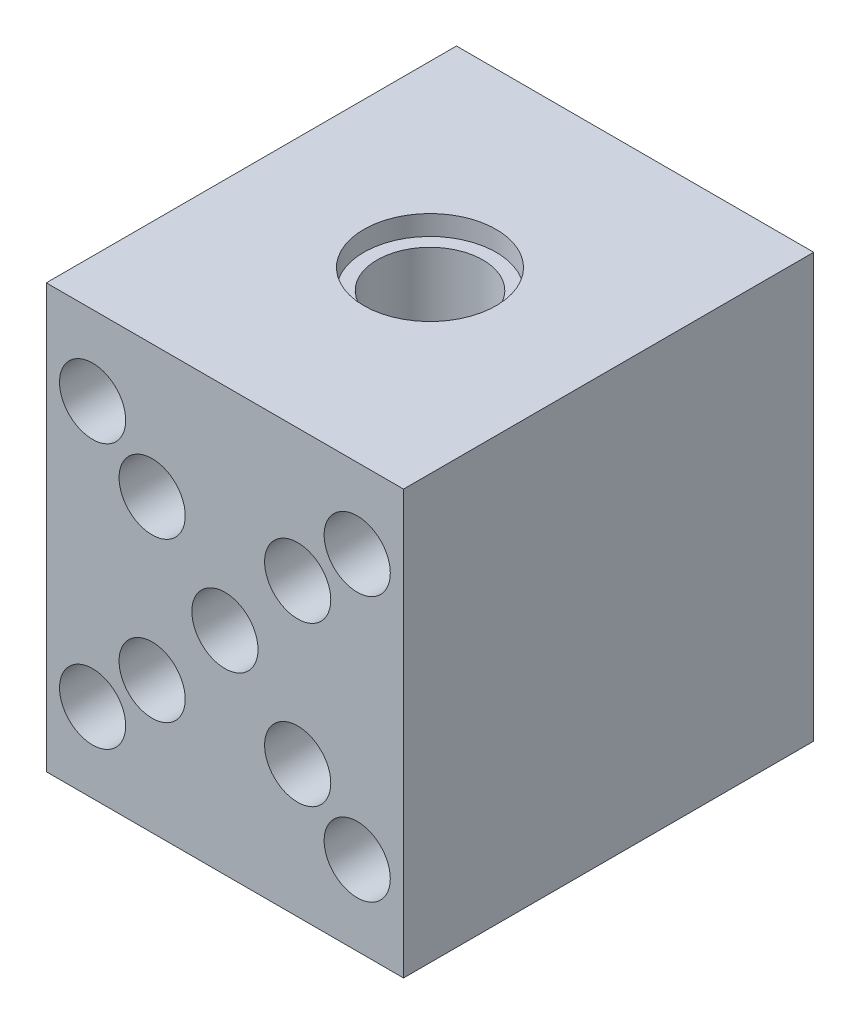
ISO-10303-21;
HEADER;
FILE_DESCRIPTION(('STEP AP214'),'2;1');
FILE_NAME('part.step','',(''),(''),'','','');
FILE_SCHEMA(('AUTOMOTIVE_DESIGN { 1 0 10303 214 1 1 1 1 }'));
ENDSEC;
DATA;
#1=APPLICATION_CONTEXT('core data for automotive mechanical design processes');
#2=APPLICATION_PROTOCOL_DEFINITION('international standard','automotive_design',2000,#1);
#3=PRODUCT_CONTEXT('',#1,'mechanical');
#4=PRODUCT('Part','Part','',(#3));
#5=PRODUCT_RELATED_PRODUCT_CATEGORY('part','',(#4));
#6=PRODUCT_DEFINITION_FORMATION('','',#4);
#7=PRODUCT_DEFINITION_CONTEXT('part definition',#1,'design');
#8=PRODUCT_DEFINITION('design','',#6,#7);
#9=PRODUCT_DEFINITION_SHAPE('','',#8);
#10=(LENGTH_UNIT() NAMED_UNIT(*) SI_UNIT(.MILLI.,.METRE.));
#11=(NAMED_UNIT(*) PLANE_ANGLE_UNIT() SI_UNIT($,.RADIAN.));
#12=(NAMED_UNIT(*) SI_UNIT($,.STERADIAN.) SOLID_ANGLE_UNIT());
#13=UNCERTAINTY_MEASURE_WITH_UNIT(LENGTH_MEASURE(1.E-05),#10,'distance_accuracy_value','');
#14=(GEOMETRIC_REPRESENTATION_CONTEXT(3) GLOBAL_UNCERTAINTY_ASSIGNED_CONTEXT((#13)) GLOBAL_UNIT_ASSIGNED_CONTEXT((#10,
#11,#12)) REPRESENTATION_CONTEXT('',''));
#15=CARTESIAN_POINT('',(0.,0.,0.));
#16=DIRECTION('',(0.,0.,1.));
#17=DIRECTION('',(1.,0.,0.));
#18=AXIS2_PLACEMENT_3D('',#15,#16,#17);
#19=CARTESIAN_POINT('',(10.,10.,31.));
#20=DIRECTION('',(0.,0.,-1.));
#21=DIRECTION('',(-1.,0.,0.));
#22=AXIS2_PLACEMENT_3D('',#19,#20,#21);
#23=CYLINDRICAL_SURFACE('',#22,1.5);
#24=CARTESIAN_POINT('',(10.,10.,0.));
#25=DIRECTION('',(0.,0.,-1.));
#26=DIRECTION('',(-1.,0.,0.));
#27=AXIS2_PLACEMENT_3D('',#24,#25,#26);
#28=CIRCLE('',#27,1.5);
#29=CARTESIAN_POINT('',(8.5,10.,0.));
#30=VERTEX_POINT('',#29);
#31=EDGE_CURVE('E115',#30,#30,#28,.T.);
#32=ORIENTED_EDGE('',*,*,#31,.T.);
#33=EDGE_LOOP('',(#32));
#34=FACE_BOUND('',#33,.T.);
#35=CARTESIAN_POINT('',(10.,10.,16.));
#36=DIRECTION('',(0.,0.,1.));
#37=DIRECTION('',(1.,0.,0.));
#38=AXIS2_PLACEMENT_3D('',#35,#36,#37);
#39=CIRCLE('',#38,1.5);
#40=CARTESIAN_POINT('',(11.5,10.,16.));
#41=VERTEX_POINT('',#40);
#42=EDGE_CURVE('E43',#41,#41,#39,.F.);
#43=ORIENTED_EDGE('',*,*,#42,.F.);
#44=EDGE_LOOP('',(#43));
#45=FACE_BOUND('',#44,.T.);
#46=ADVANCED_FACE('F39',(#34,#45),#23,.F.);
#47=CARTESIAN_POINT('',(-10.,10.,31.));
#48=DIRECTION('',(0.,0.,-1.));
#49=DIRECTION('',(-1.,0.,0.));
#50=AXIS2_PLACEMENT_3D('',#47,#48,#49);
#51=CYLINDRICAL_SURFACE('',#50,1.5);
#52=CARTESIAN_POINT('',(-10.,10.,0.));
#53=DIRECTION('',(0.,0.,-1.));
#54=DIRECTION('',(-1.,0.,0.));
#55=AXIS2_PLACEMENT_3D('',#52,#53,#54);
#56=CIRCLE('',#55,1.5);
#57=CARTESIAN_POINT('',(-11.5,10.,0.));
#58=VERTEX_POINT('',#57);
#59=EDGE_CURVE('E172',#58,#58,#56,.T.);
#60=ORIENTED_EDGE('',*,*,#59,.T.);
#61=EDGE_LOOP('',(#60));
#62=FACE_BOUND('',#61,.T.);
#63=CARTESIAN_POINT('',(-10.,10.,16.));
#64=DIRECTION('',(0.,0.,1.));
#65=DIRECTION('',(1.,0.,0.));
#66=AXIS2_PLACEMENT_3D('',#63,#64,#65);
#67=CIRCLE('',#66,1.5);
#68=CARTESIAN_POINT('',(-8.5,10.,16.));
#69=VERTEX_POINT('',#68);
#70=EDGE_CURVE('E146',#69,#69,#67,.F.);
#71=ORIENTED_EDGE('',*,*,#70,.F.);
#72=EDGE_LOOP('',(#71));
#73=FACE_BOUND('',#72,.T.);
#74=ADVANCED_FACE('F211',(#62,#73),#51,.F.);
#75=CARTESIAN_POINT('',(-10.,-10.,31.));
#76=DIRECTION('',(0.,0.,-1.));
#77=DIRECTION('',(-1.,0.,0.));
#78=AXIS2_PLACEMENT_3D('',#75,#76,#77);
#79=CYLINDRICAL_SURFACE('',#78,1.5);
#80=CARTESIAN_POINT('',(-10.,-10.,0.));
#81=DIRECTION('',(0.,0.,-1.));
#82=DIRECTION('',(-1.,0.,0.));
#83=AXIS2_PLACEMENT_3D('',#80,#81,#82);
#84=CIRCLE('',#83,1.5);
#85=CARTESIAN_POINT('',(-11.5,-10.,0.));
#86=VERTEX_POINT('',#85);
#87=EDGE_CURVE('E176',#86,#86,#84,.T.);
#88=ORIENTED_EDGE('',*,*,#87,.T.);
#89=EDGE_LOOP('',(#88));
#90=FACE_BOUND('',#89,.T.);
#91=CARTESIAN_POINT('',(-10.,-10.,16.));
#92=DIRECTION('',(0.,0.,1.));
#93=DIRECTION('',(1.,0.,0.));
#94=AXIS2_PLACEMENT_3D('',#91,#92,#93);
#95=CIRCLE('',#94,1.5);
#96=CARTESIAN_POINT('',(-8.5,-10.,16.));
#97=VERTEX_POINT('',#96);
#98=EDGE_CURVE('E142',#97,#97,#95,.F.);
#99=ORIENTED_EDGE('',*,*,#98,.F.);
#100=EDGE_LOOP('',(#99));
#101=FACE_BOUND('',#100,.T.);
#102=ADVANCED_FACE('F216',(#90,#101),#79,.F.);
#103=CARTESIAN_POINT('',(10.,-10.,31.));
#104=DIRECTION('',(0.,0.,-1.));
#105=DIRECTION('',(-1.,0.,0.));
#106=AXIS2_PLACEMENT_3D('',#103,#104,#105);
#107=CYLINDRICAL_SURFACE('',#106,1.5);
#108=CARTESIAN_POINT('',(10.,-10.,0.));
#109=DIRECTION('',(0.,0.,-1.));
#110=DIRECTION('',(-1.,0.,0.));
#111=AXIS2_PLACEMENT_3D('',#108,#109,#110);
#112=CIRCLE('',#111,1.5);
#113=CARTESIAN_POINT('',(8.5,-10.,0.));
#114=VERTEX_POINT('',#113);
#115=EDGE_CURVE('E130',#114,#114,#112,.T.);
#116=ORIENTED_EDGE('',*,*,#115,.T.);
#117=EDGE_LOOP('',(#116));
#118=FACE_BOUND('',#117,.T.);
#119=CARTESIAN_POINT('',(10.,-10.,16.));
#120=DIRECTION('',(0.,0.,1.));
#121=DIRECTION('',(1.,0.,0.));
#122=AXIS2_PLACEMENT_3D('',#119,#120,#121);
#123=CIRCLE('',#122,1.5);
#124=CARTESIAN_POINT('',(11.5,-10.,16.));
#125=VERTEX_POINT('',#124);
#126=EDGE_CURVE('E138',#125,#125,#123,.F.);
#127=ORIENTED_EDGE('',*,*,#126,.F.);
#128=EDGE_LOOP('',(#127));
#129=FACE_BOUND('',#128,.T.);
#130=ADVANCED_FACE('F220',(#118,#129),#107,.F.);
#131=CARTESIAN_POINT('',(0.,-16.,15.5));
#132=DIRECTION('',(0.,1.,0.));
#133=DIRECTION('',(0.,0.,1.));
#134=AXIS2_PLACEMENT_3D('',#131,#132,#133);
#135=CYLINDRICAL_SURFACE('',#134,4.);
#136=CARTESIAN_POINT('',(0.,14.5,15.5));
#137=DIRECTION('',(0.,1.,0.));
#138=DIRECTION('',(0.,0.,1.));
#139=AXIS2_PLACEMENT_3D('',#136,#137,#138);
#140=CIRCLE('',#139,4.);
#141=CARTESIAN_POINT('',(0.,14.5,19.5));
#142=VERTEX_POINT('',#141);
#143=EDGE_CURVE('E126',#142,#142,#140,.F.);
#144=ORIENTED_EDGE('',*,*,#143,.F.);
#145=EDGE_LOOP('',(#144));
#146=FACE_BOUND('',#145,.T.);
#147=CARTESIAN_POINT('',(0.,-14.5,15.5));
#148=DIRECTION('',(0.,-1.,0.));
#149=DIRECTION('',(0.,0.,-1.));
#150=AXIS2_PLACEMENT_3D('',#147,#148,#149);
#151=CIRCLE('',#150,4.);
#152=CARTESIAN_POINT('',(0.,-14.5,11.5));
#153=VERTEX_POINT('',#152);
#154=EDGE_CURVE('E132',#153,#153,#151,.F.);
#155=ORIENTED_EDGE('',*,*,#154,.F.);
#156=EDGE_LOOP('',(#155));
#157=FACE_BOUND('',#156,.T.);
#158=ADVANCED_FACE('F223',(#146,#157),#135,.F.);
#159=CARTESIAN_POINT('',(13.5,16.,31.));
#160=DIRECTION('',(-1.,0.,0.));
#161=DIRECTION('',(0.,-1.,0.));
#162=AXIS2_PLACEMENT_3D('',#159,#160,#161);
#163=PLANE('',#162);
#164=DIRECTION('',(0.,1.,0.));
#165=VECTOR('',#164,1.);
#166=CARTESIAN_POINT('',(13.5,16.,0.));
#167=LINE('',#166,#165);
#168=CARTESIAN_POINT('',(13.5,-16.,0.));
#169=VERTEX_POINT('',#168);
#170=CARTESIAN_POINT('',(13.5,16.,0.));
#171=VERTEX_POINT('',#170);
#172=EDGE_CURVE('E111',#169,#171,#167,.T.);
#173=ORIENTED_EDGE('',*,*,#172,.T.);
#174=DIRECTION('',(0.,0.,-1.));
#175=VECTOR('',#174,1.);
#176=CARTESIAN_POINT('',(13.5,16.,31.));
#177=LINE('',#176,#175);
#178=CARTESIAN_POINT('',(13.5,16.,31.));
#179=VERTEX_POINT('',#178);
#180=EDGE_CURVE('E11',#179,#171,#177,.T.);
#181=ORIENTED_EDGE('',*,*,#180,.F.);
#182=DIRECTION('',(0.,1.,0.));
#183=VECTOR('',#182,1.);
#184=CARTESIAN_POINT('',(13.5,16.,31.));
#185=LINE('',#184,#183);
#186=CARTESIAN_POINT('',(13.5,-16.,31.));
#187=VERTEX_POINT('',#186);
#188=EDGE_CURVE('E94',#187,#179,#185,.T.);
#189=ORIENTED_EDGE('',*,*,#188,.F.);
#190=DIRECTION('',(0.,0.,-1.));
#191=VECTOR('',#190,1.);
#192=CARTESIAN_POINT('',(13.5,-16.,31.));
#193=LINE('',#192,#191);
#194=EDGE_CURVE('E107',#187,#169,#193,.T.);
#195=ORIENTED_EDGE('',*,*,#194,.T.);
#196=EDGE_LOOP('',(#173,#181,#189,#195));
#197=FACE_BOUND('',#196,.T.);
#198=ADVANCED_FACE('F41',(#197),#163,.F.);
#199=CARTESIAN_POINT('',(-13.5,16.,31.));
#200=DIRECTION('',(0.,-1.,0.));
#201=DIRECTION('',(0.,0.,-1.));
#202=AXIS2_PLACEMENT_3D('',#199,#200,#201);
#203=PLANE('',#202);
#204=CARTESIAN_POINT('',(0.,16.,15.5));
#205=DIRECTION('',(0.,1.,0.));
#206=DIRECTION('',(0.,0.,1.));
#207=AXIS2_PLACEMENT_3D('',#204,#205,#206);
#208=CIRCLE('',#207,5.);
#209=CARTESIAN_POINT('',(0.,16.,20.5));
#210=VERTEX_POINT('',#209);
#211=EDGE_CURVE('E136',#210,#210,#208,.T.);
#212=ORIENTED_EDGE('',*,*,#211,.F.);
#213=EDGE_LOOP('',(#212));
#214=FACE_BOUND('',#213,.T.);
#215=DIRECTION('',(-1.,0.,0.));
#216=VECTOR('',#215,1.);
#217=CARTESIAN_POINT('',(-13.5,16.,0.));
#218=LINE('',#217,#216);
#219=CARTESIAN_POINT('',(-13.5,16.,0.));
#220=VERTEX_POINT('',#219);
#221=EDGE_CURVE('E99',#171,#220,#218,.T.);
#222=ORIENTED_EDGE('',*,*,#221,.T.);
#223=DIRECTION('',(0.,0.,-1.));
#224=VECTOR('',#223,1.);
#225=CARTESIAN_POINT('',(-13.5,16.,31.));
#226=LINE('',#225,#224);
#227=CARTESIAN_POINT('',(-13.5,16.,31.));
#228=VERTEX_POINT('',#227);
#229=EDGE_CURVE('E50',#228,#220,#226,.T.);
#230=ORIENTED_EDGE('',*,*,#229,.F.);
#231=DIRECTION('',(-1.,0.,0.));
#232=VECTOR('',#231,1.);
#233=CARTESIAN_POINT('',(-13.5,16.,31.));
#234=LINE('',#233,#232);
#235=EDGE_CURVE('E89',#179,#228,#234,.T.);
#236=ORIENTED_EDGE('',*,*,#235,.F.);
#237=ORIENTED_EDGE('',*,*,#180,.T.);
#238=EDGE_LOOP('',(#222,#230,#236,#237));
#239=FACE_BOUND('',#238,.T.);
#240=ADVANCED_FACE('F98',(#214,#239),#203,.F.);
#241=CARTESIAN_POINT('',(-13.5,16.,31.));
#242=DIRECTION('',(1.,0.,0.));
#243=DIRECTION('',(0.,1.,0.));
#244=AXIS2_PLACEMENT_3D('',#241,#242,#243);
#245=PLANE('',#244);
#246=DIRECTION('',(0.,-1.,0.));
#247=VECTOR('',#246,1.);
#248=CARTESIAN_POINT('',(-13.5,16.,0.));
#249=LINE('',#248,#247);
#250=CARTESIAN_POINT('',(-13.5,-16.,0.));
#251=VERTEX_POINT('',#250);
#252=EDGE_CURVE('E76',#220,#251,#249,.T.);
#253=ORIENTED_EDGE('',*,*,#252,.T.);
#254=DIRECTION('',(0.,0.,-1.));
#255=VECTOR('',#254,1.);
#256=CARTESIAN_POINT('',(-13.5,-16.,31.));
#257=LINE('',#256,#255);
#258=CARTESIAN_POINT('',(-13.5,-16.,31.));
#259=VERTEX_POINT('',#258);
#260=EDGE_CURVE('E101',#259,#251,#257,.T.);
#261=ORIENTED_EDGE('',*,*,#260,.F.);
#262=DIRECTION('',(0.,-1.,0.));
#263=VECTOR('',#262,1.);
#264=CARTESIAN_POINT('',(-13.5,16.,31.));
#265=LINE('',#264,#263);
#266=EDGE_CURVE('E92',#228,#259,#265,.T.);
#267=ORIENTED_EDGE('',*,*,#266,.F.);
#268=ORIENTED_EDGE('',*,*,#229,.T.);
#269=EDGE_LOOP('',(#253,#261,#267,#268));
#270=FACE_BOUND('',#269,.T.);
#271=ADVANCED_FACE('F103',(#270),#245,.F.);
#272=CARTESIAN_POINT('',(-13.5,-16.,31.));
#273=DIRECTION('',(0.,1.,0.));
#274=DIRECTION('',(0.,0.,1.));
#275=AXIS2_PLACEMENT_3D('',#272,#273,#274);
#276=PLANE('',#275);
#277=CARTESIAN_POINT('',(0.,-16.,15.5));
#278=DIRECTION('',(0.,-1.,0.));
#279=DIRECTION('',(0.,0.,-1.));
#280=AXIS2_PLACEMENT_3D('',#277,#278,#279);
#281=CIRCLE('',#280,5.);
#282=CARTESIAN_POINT('',(0.,-16.,10.5));
#283=VERTEX_POINT('',#282);
#284=EDGE_CURVE('E153',#283,#283,#281,.T.);
#285=ORIENTED_EDGE('',*,*,#284,.F.);
#286=EDGE_LOOP('',(#285));
#287=FACE_BOUND('',#286,.T.);
#288=DIRECTION('',(1.,0.,0.));
#289=VECTOR('',#288,1.);
#290=CARTESIAN_POINT('',(-13.5,-16.,0.));
#291=LINE('',#290,#289);
#292=EDGE_CURVE('E82',#251,#169,#291,.T.);
#293=ORIENTED_EDGE('',*,*,#292,.T.);
#294=ORIENTED_EDGE('',*,*,#194,.F.);
#295=DIRECTION('',(1.,0.,0.));
#296=VECTOR('',#295,1.);
#297=CARTESIAN_POINT('',(-13.5,-16.,31.));
#298=LINE('',#297,#296);
#299=EDGE_CURVE('E59',#259,#187,#298,.T.);
#300=ORIENTED_EDGE('',*,*,#299,.F.);
#301=ORIENTED_EDGE('',*,*,#260,.T.);
#302=EDGE_LOOP('',(#293,#294,#300,#301));
#303=FACE_BOUND('',#302,.T.);
#304=ADVANCED_FACE('F198',(#287,#303),#276,.F.);
#305=CARTESIAN_POINT('',(0.,0.,31.));
#306=DIRECTION('',(0.,0.,1.));
#307=DIRECTION('',(1.,0.,0.));
#308=AXIS2_PLACEMENT_3D('',#305,#306,#307);
#309=PLANE('',#308);
#310=CARTESIAN_POINT('',(-5.5,-6.,31.));
#311=DIRECTION('',(0.,0.,1.));
#312=DIRECTION('',(1.,0.,0.));
#313=AXIS2_PLACEMENT_3D('',#310,#311,#312);
#314=CIRCLE('',#313,2.5);
#315=CARTESIAN_POINT('',(-3.,-6.,31.));
#316=VERTEX_POINT('',#315);
#317=EDGE_CURVE('E354',#316,#316,#314,.T.);
#318=ORIENTED_EDGE('',*,*,#317,.F.);
#319=EDGE_LOOP('',(#318));
#320=FACE_BOUND('',#319,.T.);
#321=CARTESIAN_POINT('',(5.5,-6.,31.));
#322=DIRECTION('',(0.,0.,1.));
#323=DIRECTION('',(1.,0.,0.));
#324=AXIS2_PLACEMENT_3D('',#321,#322,#323);
#325=CIRCLE('',#324,2.5);
#326=CARTESIAN_POINT('',(8.,-6.,31.));
#327=VERTEX_POINT('',#326);
#328=EDGE_CURVE('E346',#327,#327,#325,.T.);
#329=ORIENTED_EDGE('',*,*,#328,.F.);
#330=EDGE_LOOP('',(#329));
#331=FACE_BOUND('',#330,.T.);
#332=CARTESIAN_POINT('',(0.,0.,31.));
#333=DIRECTION('',(0.,0.,1.));
#334=DIRECTION('',(1.,0.,0.));
#335=AXIS2_PLACEMENT_3D('',#332,#333,#334);
#336=CIRCLE('',#335,2.5);
#337=CARTESIAN_POINT('',(2.5,0.,31.));
#338=VERTEX_POINT('',#337);
#339=EDGE_CURVE('E338',#338,#338,#336,.T.);
#340=ORIENTED_EDGE('',*,*,#339,.F.);
#341=EDGE_LOOP('',(#340));
#342=FACE_BOUND('',#341,.T.);
#343=CARTESIAN_POINT('',(5.5,6.,31.));
#344=DIRECTION('',(0.,0.,1.));
#345=DIRECTION('',(1.,0.,0.));
#346=AXIS2_PLACEMENT_3D('',#343,#344,#345);
#347=CIRCLE('',#346,2.5);
#348=CARTESIAN_POINT('',(8.,6.,31.));
#349=VERTEX_POINT('',#348);
#350=EDGE_CURVE('E324',#349,#349,#347,.T.);
#351=ORIENTED_EDGE('',*,*,#350,.F.);
#352=EDGE_LOOP('',(#351));
#353=FACE_BOUND('',#352,.T.);
#354=CARTESIAN_POINT('',(-5.5,6.,31.));
#355=DIRECTION('',(0.,0.,1.));
#356=DIRECTION('',(1.,0.,0.));
#357=AXIS2_PLACEMENT_3D('',#354,#355,#356);
#358=CIRCLE('',#357,2.5);
#359=CARTESIAN_POINT('',(-3.,6.,31.));
#360=VERTEX_POINT('',#359);
#361=EDGE_CURVE('E323',#360,#360,#358,.T.);
#362=ORIENTED_EDGE('',*,*,#361,.F.);
#363=EDGE_LOOP('',(#362));
#364=FACE_BOUND('',#363,.T.);
#365=CARTESIAN_POINT('',(-10.,-10.,31.));
#366=DIRECTION('',(0.,0.,1.));
#367=DIRECTION('',(1.,0.,0.));
#368=AXIS2_PLACEMENT_3D('',#365,#366,#367);
#369=CIRCLE('',#368,2.5);
#370=CARTESIAN_POINT('',(-7.5,-10.,31.));
#371=VERTEX_POINT('',#370);
#372=EDGE_CURVE('E360',#371,#371,#369,.T.);
#373=ORIENTED_EDGE('',*,*,#372,.F.);
#374=EDGE_LOOP('',(#373));
#375=FACE_BOUND('',#374,.T.);
#376=CARTESIAN_POINT('',(10.,-10.,31.));
#377=DIRECTION('',(0.,0.,1.));
#378=DIRECTION('',(1.,0.,0.));
#379=AXIS2_PLACEMENT_3D('',#376,#377,#378);
#380=CIRCLE('',#379,2.5);
#381=CARTESIAN_POINT('',(12.5,-10.,31.));
#382=VERTEX_POINT('',#381);
#383=EDGE_CURVE('E375',#382,#382,#380,.T.);
#384=ORIENTED_EDGE('',*,*,#383,.F.);
#385=EDGE_LOOP('',(#384));
#386=FACE_BOUND('',#385,.T.);
#387=CARTESIAN_POINT('',(10.,10.,31.));
#388=DIRECTION('',(0.,0.,1.));
#389=DIRECTION('',(1.,0.,0.));
#390=AXIS2_PLACEMENT_3D('',#387,#388,#389);
#391=CIRCLE('',#390,2.5);
#392=CARTESIAN_POINT('',(12.5,10.,31.));
#393=VERTEX_POINT('',#392);
#394=EDGE_CURVE('E367',#393,#393,#391,.T.);
#395=ORIENTED_EDGE('',*,*,#394,.F.);
#396=EDGE_LOOP('',(#395));
#397=FACE_BOUND('',#396,.T.);
#398=CARTESIAN_POINT('',(-10.,10.,31.));
#399=DIRECTION('',(0.,0.,1.));
#400=DIRECTION('',(1.,0.,0.));
#401=AXIS2_PLACEMENT_3D('',#398,#399,#400);
#402=CIRCLE('',#401,2.5);
#403=CARTESIAN_POINT('',(-7.5,10.,31.));
#404=VERTEX_POINT('',#403);
#405=EDGE_CURVE('E366',#404,#404,#402,.T.);
#406=ORIENTED_EDGE('',*,*,#405,.F.);
#407=EDGE_LOOP('',(#406));
#408=FACE_BOUND('',#407,.T.);
#409=ORIENTED_EDGE('',*,*,#188,.T.);
#410=ORIENTED_EDGE('',*,*,#235,.T.);
#411=ORIENTED_EDGE('',*,*,#266,.T.);
#412=ORIENTED_EDGE('',*,*,#299,.T.);
#413=EDGE_LOOP('',(#409,#410,#411,#412));
#414=FACE_BOUND('',#413,.T.);
#415=ADVANCED_FACE('F90',(#320,#331,#342,#353,#364,#375,#386,#397,#408,#414),#309,.T.);
#416=CARTESIAN_POINT('',(0.,0.,0.));
#417=DIRECTION('',(0.,0.,1.));
#418=DIRECTION('',(1.,0.,0.));
#419=AXIS2_PLACEMENT_3D('',#416,#417,#418);
#420=PLANE('',#419);
#421=ORIENTED_EDGE('',*,*,#115,.F.);
#422=EDGE_LOOP('',(#421));
#423=FACE_BOUND('',#422,.T.);
#424=ORIENTED_EDGE('',*,*,#87,.F.);
#425=EDGE_LOOP('',(#424));
#426=FACE_BOUND('',#425,.T.);
#427=ORIENTED_EDGE('',*,*,#59,.F.);
#428=EDGE_LOOP('',(#427));
#429=FACE_BOUND('',#428,.T.);
#430=ORIENTED_EDGE('',*,*,#31,.F.);
#431=EDGE_LOOP('',(#430));
#432=FACE_BOUND('',#431,.T.);
#433=ORIENTED_EDGE('',*,*,#172,.F.);
#434=ORIENTED_EDGE('',*,*,#292,.F.);
#435=ORIENTED_EDGE('',*,*,#252,.F.);
#436=ORIENTED_EDGE('',*,*,#221,.F.);
#437=EDGE_LOOP('',(#433,#434,#435,#436));
#438=FACE_BOUND('',#437,.T.);
#439=ADVANCED_FACE('F190',(#423,#426,#429,#432,#438),#420,.F.);
#440=CARTESIAN_POINT('',(0.,14.5,15.5));
#441=DIRECTION('',(0.,1.,0.));
#442=DIRECTION('',(0.,0.,1.));
#443=AXIS2_PLACEMENT_3D('',#440,#441,#442);
#444=PLANE('',#443);
#445=CARTESIAN_POINT('',(0.,14.5,15.5));
#446=DIRECTION('',(0.,1.,0.));
#447=DIRECTION('',(0.,0.,1.));
#448=AXIS2_PLACEMENT_3D('',#445,#446,#447);
#449=CIRCLE('',#448,5.);
#450=CARTESIAN_POINT('',(0.,14.5,20.5));
#451=VERTEX_POINT('',#450);
#452=EDGE_CURVE('E131',#451,#451,#449,.T.);
#453=ORIENTED_EDGE('',*,*,#452,.T.);
#454=EDGE_LOOP('',(#453));
#455=FACE_BOUND('',#454,.T.);
#456=ORIENTED_EDGE('',*,*,#143,.T.);
#457=EDGE_LOOP('',(#456));
#458=FACE_BOUND('',#457,.T.);
#459=ADVANCED_FACE('F193',(#455,#458),#444,.T.);
#460=CARTESIAN_POINT('',(0.,14.5,15.5));
#461=DIRECTION('',(0.,1.,0.));
#462=DIRECTION('',(0.,0.,1.));
#463=AXIS2_PLACEMENT_3D('',#460,#461,#462);
#464=CYLINDRICAL_SURFACE('',#463,5.);
#465=ORIENTED_EDGE('',*,*,#452,.F.);
#466=EDGE_LOOP('',(#465));
#467=FACE_BOUND('',#466,.T.);
#468=ORIENTED_EDGE('',*,*,#211,.T.);
#469=EDGE_LOOP('',(#468));
#470=FACE_BOUND('',#469,.T.);
#471=ADVANCED_FACE('F231',(#467,#470),#464,.F.);
#472=CARTESIAN_POINT('',(0.,-14.5,15.5));
#473=DIRECTION('',(0.,-1.,0.));
#474=DIRECTION('',(0.,0.,-1.));
#475=AXIS2_PLACEMENT_3D('',#472,#473,#474);
#476=PLANE('',#475);
#477=CARTESIAN_POINT('',(0.,-14.5,15.5));
#478=DIRECTION('',(0.,-1.,0.));
#479=DIRECTION('',(0.,0.,-1.));
#480=AXIS2_PLACEMENT_3D('',#477,#478,#479);
#481=CIRCLE('',#480,5.);
#482=CARTESIAN_POINT('',(0.,-14.5,10.5));
#483=VERTEX_POINT('',#482);
#484=EDGE_CURVE('E137',#483,#483,#481,.T.);
#485=ORIENTED_EDGE('',*,*,#484,.T.);
#486=EDGE_LOOP('',(#485));
#487=FACE_BOUND('',#486,.T.);
#488=ORIENTED_EDGE('',*,*,#154,.T.);
#489=EDGE_LOOP('',(#488));
#490=FACE_BOUND('',#489,.T.);
#491=ADVANCED_FACE('F234',(#487,#490),#476,.T.);
#492=CARTESIAN_POINT('',(0.,-14.5,15.5));
#493=DIRECTION('',(0.,-1.,0.));
#494=DIRECTION('',(0.,0.,-1.));
#495=AXIS2_PLACEMENT_3D('',#492,#493,#494);
#496=CYLINDRICAL_SURFACE('',#495,5.);
#497=ORIENTED_EDGE('',*,*,#484,.F.);
#498=EDGE_LOOP('',(#497));
#499=FACE_BOUND('',#498,.T.);
#500=ORIENTED_EDGE('',*,*,#284,.T.);
#501=EDGE_LOOP('',(#500));
#502=FACE_BOUND('',#501,.T.);
#503=ADVANCED_FACE('F239',(#499,#502),#496,.F.);
#504=CARTESIAN_POINT('',(10.,-10.,16.));
#505=DIRECTION('',(0.,0.,1.));
#506=DIRECTION('',(1.,0.,0.));
#507=AXIS2_PLACEMENT_3D('',#504,#505,#506);
#508=PLANE('',#507);
#509=CARTESIAN_POINT('',(10.,-10.,16.));
#510=DIRECTION('',(0.,0.,1.));
#511=DIRECTION('',(1.,0.,0.));
#512=AXIS2_PLACEMENT_3D('',#509,#510,#511);
#513=CIRCLE('',#512,2.5);
#514=CARTESIAN_POINT('',(12.5,-10.,16.));
#515=VERTEX_POINT('',#514);
#516=EDGE_CURVE('E371',#515,#515,#513,.T.);
#517=ORIENTED_EDGE('',*,*,#516,.T.);
#518=EDGE_LOOP('',(#517));
#519=FACE_BOUND('',#518,.T.);
#520=ORIENTED_EDGE('',*,*,#126,.T.);
#521=EDGE_LOOP('',(#520));
#522=FACE_BOUND('',#521,.T.);
#523=ADVANCED_FACE('F242',(#519,#522),#508,.T.);
#524=CARTESIAN_POINT('',(10.,-10.,16.));
#525=DIRECTION('',(0.,0.,1.));
#526=DIRECTION('',(1.,0.,0.));
#527=AXIS2_PLACEMENT_3D('',#524,#525,#526);
#528=CYLINDRICAL_SURFACE('',#527,2.5);
#529=ORIENTED_EDGE('',*,*,#516,.F.);
#530=EDGE_LOOP('',(#529));
#531=FACE_BOUND('',#530,.T.);
#532=ORIENTED_EDGE('',*,*,#383,.T.);
#533=EDGE_LOOP('',(#532));
#534=FACE_BOUND('',#533,.T.);
#535=ADVANCED_FACE('F263',(#531,#534),#528,.F.);
#536=CARTESIAN_POINT('',(-10.,-10.,16.));
#537=DIRECTION('',(0.,0.,1.));
#538=DIRECTION('',(1.,0.,0.));
#539=AXIS2_PLACEMENT_3D('',#536,#537,#538);
#540=PLANE('',#539);
#541=CARTESIAN_POINT('',(-10.,-10.,16.));
#542=DIRECTION('',(0.,0.,1.));
#543=DIRECTION('',(1.,0.,0.));
#544=AXIS2_PLACEMENT_3D('',#541,#542,#543);
#545=CIRCLE('',#544,2.5);
#546=CARTESIAN_POINT('',(-7.5,-10.,16.));
#547=VERTEX_POINT('',#546);
#548=EDGE_CURVE('E379',#547,#547,#545,.T.);
#549=ORIENTED_EDGE('',*,*,#548,.T.);
#550=EDGE_LOOP('',(#549));
#551=FACE_BOUND('',#550,.T.);
#552=ORIENTED_EDGE('',*,*,#98,.T.);
#553=EDGE_LOOP('',(#552));
#554=FACE_BOUND('',#553,.T.);
#555=ADVANCED_FACE('F259',(#551,#554),#540,.T.);
#556=CARTESIAN_POINT('',(-10.,-10.,16.));
#557=DIRECTION('',(0.,0.,1.));
#558=DIRECTION('',(1.,0.,0.));
#559=AXIS2_PLACEMENT_3D('',#556,#557,#558);
#560=CYLINDRICAL_SURFACE('',#559,2.5);
#561=ORIENTED_EDGE('',*,*,#548,.F.);
#562=EDGE_LOOP('',(#561));
#563=FACE_BOUND('',#562,.T.);
#564=ORIENTED_EDGE('',*,*,#372,.T.);
#565=EDGE_LOOP('',(#564));
#566=FACE_BOUND('',#565,.T.);
#567=ADVANCED_FACE('F255',(#563,#566),#560,.F.);
#568=CARTESIAN_POINT('',(-10.,10.,16.));
#569=DIRECTION('',(0.,0.,1.));
#570=DIRECTION('',(1.,0.,0.));
#571=AXIS2_PLACEMENT_3D('',#568,#569,#570);
#572=PLANE('',#571);
#573=CARTESIAN_POINT('',(-10.,10.,16.));
#574=DIRECTION('',(0.,0.,1.));
#575=DIRECTION('',(1.,0.,0.));
#576=AXIS2_PLACEMENT_3D('',#573,#574,#575);
#577=CIRCLE('',#576,2.5);
#578=CARTESIAN_POINT('',(-7.5,10.,16.));
#579=VERTEX_POINT('',#578);
#580=EDGE_CURVE('E143',#579,#579,#577,.T.);
#581=ORIENTED_EDGE('',*,*,#580,.T.);
#582=EDGE_LOOP('',(#581));
#583=FACE_BOUND('',#582,.T.);
#584=ORIENTED_EDGE('',*,*,#70,.T.);
#585=EDGE_LOOP('',(#584));
#586=FACE_BOUND('',#585,.T.);
#587=ADVANCED_FACE('F251',(#583,#586),#572,.T.);
#588=CARTESIAN_POINT('',(-10.,10.,16.));
#589=DIRECTION('',(0.,0.,1.));
#590=DIRECTION('',(1.,0.,0.));
#591=AXIS2_PLACEMENT_3D('',#588,#589,#590);
#592=CYLINDRICAL_SURFACE('',#591,2.5);
#593=ORIENTED_EDGE('',*,*,#580,.F.);
#594=EDGE_LOOP('',(#593));
#595=FACE_BOUND('',#594,.T.);
#596=ORIENTED_EDGE('',*,*,#405,.T.);
#597=EDGE_LOOP('',(#596));
#598=FACE_BOUND('',#597,.T.);
#599=ADVANCED_FACE('F247',(#595,#598),#592,.F.);
#600=CARTESIAN_POINT('',(10.,10.,16.));
#601=DIRECTION('',(0.,0.,1.));
#602=DIRECTION('',(1.,0.,0.));
#603=AXIS2_PLACEMENT_3D('',#600,#601,#602);
#604=PLANE('',#603);
#605=CARTESIAN_POINT('',(10.,10.,16.));
#606=DIRECTION('',(0.,0.,1.));
#607=DIRECTION('',(1.,0.,0.));
#608=AXIS2_PLACEMENT_3D('',#605,#606,#607);
#609=CIRCLE('',#608,2.5);
#610=CARTESIAN_POINT('',(12.5,10.,16.));
#611=VERTEX_POINT('',#610);
#612=EDGE_CURVE('E362',#611,#611,#609,.T.);
#613=ORIENTED_EDGE('',*,*,#612,.T.);
#614=EDGE_LOOP('',(#613));
#615=FACE_BOUND('',#614,.T.);
#616=ORIENTED_EDGE('',*,*,#42,.T.);
#617=EDGE_LOOP('',(#616));
#618=FACE_BOUND('',#617,.T.);
#619=ADVANCED_FACE('F250',(#615,#618),#604,.T.);
#620=CARTESIAN_POINT('',(10.,10.,16.));
#621=DIRECTION('',(0.,0.,1.));
#622=DIRECTION('',(1.,0.,0.));
#623=AXIS2_PLACEMENT_3D('',#620,#621,#622);
#624=CYLINDRICAL_SURFACE('',#623,2.5);
#625=ORIENTED_EDGE('',*,*,#612,.F.);
#626=EDGE_LOOP('',(#625));
#627=FACE_BOUND('',#626,.T.);
#628=ORIENTED_EDGE('',*,*,#394,.T.);
#629=EDGE_LOOP('',(#628));
#630=FACE_BOUND('',#629,.T.);
#631=ADVANCED_FACE('F271',(#627,#630),#624,.F.);
#632=CARTESIAN_POINT('',(-5.5,6.,21.));
#633=DIRECTION('',(0.,0.,1.));
#634=DIRECTION('',(1.,0.,0.));
#635=AXIS2_PLACEMENT_3D('',#632,#633,#634);
#636=CYLINDRICAL_SURFACE('',#635,2.5);
#637=CARTESIAN_POINT('',(-5.5,6.,21.));
#638=DIRECTION('',(0.,0.,1.));
#639=DIRECTION('',(1.,0.,0.));
#640=AXIS2_PLACEMENT_3D('',#637,#638,#639);
#641=CIRCLE('',#640,2.5);
#642=CARTESIAN_POINT('',(-3.,6.,21.));
#643=VERTEX_POINT('',#642);
#644=EDGE_CURVE('E329',#643,#643,#641,.T.);
#645=ORIENTED_EDGE('',*,*,#644,.F.);
#646=EDGE_LOOP('',(#645));
#647=FACE_BOUND('',#646,.T.);
#648=ORIENTED_EDGE('',*,*,#361,.T.);
#649=EDGE_LOOP('',(#648));
#650=FACE_BOUND('',#649,.T.);
#651=ADVANCED_FACE('F274',(#647,#650),#636,.F.);
#652=CARTESIAN_POINT('',(-5.5,6.,21.));
#653=DIRECTION('',(0.,0.,1.));
#654=DIRECTION('',(1.,0.,0.));
#655=AXIS2_PLACEMENT_3D('',#652,#653,#654);
#656=PLANE('',#655);
#657=ORIENTED_EDGE('',*,*,#644,.T.);
#658=EDGE_LOOP('',(#657));
#659=FACE_BOUND('',#658,.T.);
#660=ADVANCED_FACE('F281',(#659),#656,.T.);
#661=CARTESIAN_POINT('',(5.5,6.,21.));
#662=DIRECTION('',(0.,0.,1.));
#663=DIRECTION('',(1.,0.,0.));
#664=AXIS2_PLACEMENT_3D('',#661,#662,#663);
#665=CYLINDRICAL_SURFACE('',#664,2.5);
#666=CARTESIAN_POINT('',(5.5,6.,21.));
#667=DIRECTION('',(0.,0.,1.));
#668=DIRECTION('',(1.,0.,0.));
#669=AXIS2_PLACEMENT_3D('',#666,#667,#668);
#670=CIRCLE('',#669,2.5);
#671=CARTESIAN_POINT('',(8.,6.,21.));
#672=VERTEX_POINT('',#671);
#673=EDGE_CURVE('E321',#672,#672,#670,.T.);
#674=ORIENTED_EDGE('',*,*,#673,.F.);
#675=EDGE_LOOP('',(#674));
#676=FACE_BOUND('',#675,.T.);
#677=ORIENTED_EDGE('',*,*,#350,.T.);
#678=EDGE_LOOP('',(#677));
#679=FACE_BOUND('',#678,.T.);
#680=ADVANCED_FACE('F285',(#676,#679),#665,.F.);
#681=CARTESIAN_POINT('',(5.5,6.,21.));
#682=DIRECTION('',(0.,0.,1.));
#683=DIRECTION('',(1.,0.,0.));
#684=AXIS2_PLACEMENT_3D('',#681,#682,#683);
#685=PLANE('',#684);
#686=ORIENTED_EDGE('',*,*,#673,.T.);
#687=EDGE_LOOP('',(#686));
#688=FACE_BOUND('',#687,.T.);
#689=ADVANCED_FACE('F307',(#688),#685,.T.);
#690=CARTESIAN_POINT('',(0.,0.,21.));
#691=DIRECTION('',(0.,0.,1.));
#692=DIRECTION('',(1.,0.,0.));
#693=AXIS2_PLACEMENT_3D('',#690,#691,#692);
#694=CYLINDRICAL_SURFACE('',#693,2.5);
#695=CARTESIAN_POINT('',(0.,0.,21.));
#696=DIRECTION('',(0.,0.,1.));
#697=DIRECTION('',(1.,0.,0.));
#698=AXIS2_PLACEMENT_3D('',#695,#696,#697);
#699=CIRCLE('',#698,2.5);
#700=CARTESIAN_POINT('',(2.5,0.,21.));
#701=VERTEX_POINT('',#700);
#702=EDGE_CURVE('E332',#701,#701,#699,.T.);
#703=ORIENTED_EDGE('',*,*,#702,.F.);
#704=EDGE_LOOP('',(#703));
#705=FACE_BOUND('',#704,.T.);
#706=ORIENTED_EDGE('',*,*,#339,.T.);
#707=EDGE_LOOP('',(#706));
#708=FACE_BOUND('',#707,.T.);
#709=ADVANCED_FACE('F304',(#705,#708),#694,.F.);
#710=CARTESIAN_POINT('',(0.,0.,21.));
#711=DIRECTION('',(0.,0.,1.));
#712=DIRECTION('',(1.,0.,0.));
#713=AXIS2_PLACEMENT_3D('',#710,#711,#712);
#714=PLANE('',#713);
#715=ORIENTED_EDGE('',*,*,#702,.T.);
#716=EDGE_LOOP('',(#715));
#717=FACE_BOUND('',#716,.T.);
#718=ADVANCED_FACE('F299',(#717),#714,.T.);
#719=CARTESIAN_POINT('',(5.5,-6.,21.));
#720=DIRECTION('',(0.,0.,1.));
#721=DIRECTION('',(1.,0.,0.));
#722=AXIS2_PLACEMENT_3D('',#719,#720,#721);
#723=CYLINDRICAL_SURFACE('',#722,2.5);
#724=CARTESIAN_POINT('',(5.5,-6.,21.));
#725=DIRECTION('',(0.,0.,1.));
#726=DIRECTION('',(1.,0.,0.));
#727=AXIS2_PLACEMENT_3D('',#724,#725,#726);
#728=CIRCLE('',#727,2.5);
#729=CARTESIAN_POINT('',(8.,-6.,21.));
#730=VERTEX_POINT('',#729);
#731=EDGE_CURVE('E342',#730,#730,#728,.T.);
#732=ORIENTED_EDGE('',*,*,#731,.F.);
#733=EDGE_LOOP('',(#732));
#734=FACE_BOUND('',#733,.T.);
#735=ORIENTED_EDGE('',*,*,#328,.T.);
#736=EDGE_LOOP('',(#735));
#737=FACE_BOUND('',#736,.T.);
#738=ADVANCED_FACE('F296',(#734,#737),#723,.F.);
#739=CARTESIAN_POINT('',(5.5,-6.,21.));
#740=DIRECTION('',(0.,0.,1.));
#741=DIRECTION('',(1.,0.,0.));
#742=AXIS2_PLACEMENT_3D('',#739,#740,#741);
#743=PLANE('',#742);
#744=ORIENTED_EDGE('',*,*,#731,.T.);
#745=EDGE_LOOP('',(#744));
#746=FACE_BOUND('',#745,.T.);
#747=ADVANCED_FACE('F291',(#746),#743,.T.);
#748=CARTESIAN_POINT('',(-5.5,-6.,21.));
#749=DIRECTION('',(0.,0.,1.));
#750=DIRECTION('',(1.,0.,0.));
#751=AXIS2_PLACEMENT_3D('',#748,#749,#750);
#752=CYLINDRICAL_SURFACE('',#751,2.5);
#753=CARTESIAN_POINT('',(-5.5,-6.,21.));
#754=DIRECTION('',(0.,0.,1.));
#755=DIRECTION('',(1.,0.,0.));
#756=AXIS2_PLACEMENT_3D('',#753,#754,#755);
#757=CIRCLE('',#756,2.5);
#758=CARTESIAN_POINT('',(-3.,-6.,21.));
#759=VERTEX_POINT('',#758);
#760=EDGE_CURVE('E350',#759,#759,#757,.T.);
#761=ORIENTED_EDGE('',*,*,#760,.F.);
#762=EDGE_LOOP('',(#761));
#763=FACE_BOUND('',#762,.T.);
#764=ORIENTED_EDGE('',*,*,#317,.T.);
#765=EDGE_LOOP('',(#764));
#766=FACE_BOUND('',#765,.T.);
#767=ADVANCED_FACE('F287',(#763,#766),#752,.F.);
#768=CARTESIAN_POINT('',(-5.5,-6.,21.));
#769=DIRECTION('',(0.,0.,1.));
#770=DIRECTION('',(1.,0.,0.));
#771=AXIS2_PLACEMENT_3D('',#768,#769,#770);
#772=PLANE('',#771);
#773=ORIENTED_EDGE('',*,*,#760,.T.);
#774=EDGE_LOOP('',(#773));
#775=FACE_BOUND('',#774,.T.);
#776=ADVANCED_FACE('F290',(#775),#772,.T.);
#777=CLOSED_SHELL('',(#46,#74,#102,#130,#158,#198,#240,#271,#304,#415,#439,#459,#471,#491,#503,
#523,#535,#555,#567,#587,#599,#619,#631,#651,#660,#680,#689,#709,#718,#738,#747,#767,#776));
#778=MANIFOLD_SOLID_BREP('B2',#777);
#779=ADVANCED_BREP_SHAPE_REPRESENTATION('',(#18,#778),#14);
#780=SHAPE_DEFINITION_REPRESENTATION(#9,#779);
ENDSEC;
END-ISO-10303-21;
